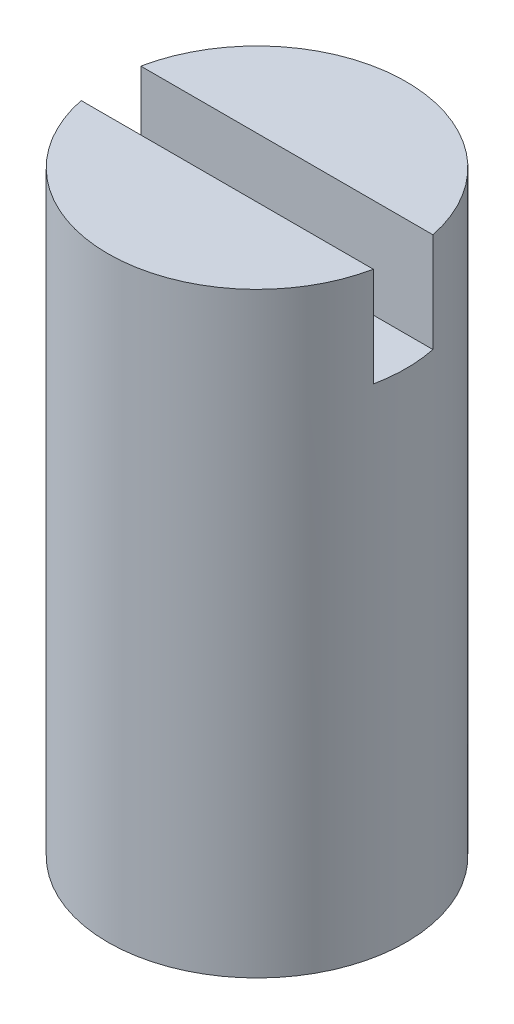
ISO-10303-21;
HEADER;
FILE_DESCRIPTION(('STEP AP214'),'2;1');
FILE_NAME('part.step','',(''),(''),'','','');
FILE_SCHEMA(('AUTOMOTIVE_DESIGN { 1 0 10303 214 1 1 1 1 }'));
ENDSEC;
DATA;
#1=APPLICATION_CONTEXT('core data for automotive mechanical design processes');
#2=APPLICATION_PROTOCOL_DEFINITION('international standard','automotive_design',2000,#1);
#3=PRODUCT_CONTEXT('',#1,'mechanical');
#4=PRODUCT('Part','Part','',(#3));
#5=PRODUCT_RELATED_PRODUCT_CATEGORY('part','',(#4));
#6=PRODUCT_DEFINITION_FORMATION('','',#4);
#7=PRODUCT_DEFINITION_CONTEXT('part definition',#1,'design');
#8=PRODUCT_DEFINITION('design','',#6,#7);
#9=PRODUCT_DEFINITION_SHAPE('','',#8);
#10=(LENGTH_UNIT() NAMED_UNIT(*) SI_UNIT(.MILLI.,.METRE.));
#11=(NAMED_UNIT(*) PLANE_ANGLE_UNIT() SI_UNIT($,.RADIAN.));
#12=(NAMED_UNIT(*) SI_UNIT($,.STERADIAN.) SOLID_ANGLE_UNIT());
#13=UNCERTAINTY_MEASURE_WITH_UNIT(LENGTH_MEASURE(1.E-05),#10,'distance_accuracy_value','');
#14=(GEOMETRIC_REPRESENTATION_CONTEXT(3) GLOBAL_UNCERTAINTY_ASSIGNED_CONTEXT((#13)) GLOBAL_UNIT_ASSIGNED_CONTEXT((#10,
#11,#12)) REPRESENTATION_CONTEXT('',''));
#15=CARTESIAN_POINT('',(0.,0.,0.));
#16=DIRECTION('',(0.,0.,1.));
#17=DIRECTION('',(1.,0.,0.));
#18=AXIS2_PLACEMENT_3D('',#15,#16,#17);
#19=CARTESIAN_POINT('',(0.,0.,0.));
#20=DIRECTION('',(0.,1.,0.));
#21=DIRECTION('',(0.,0.,1.));
#22=AXIS2_PLACEMENT_3D('',#19,#20,#21);
#23=PLANE('',#22);
#24=DIRECTION('',(-1.,0.,0.));
#25=VECTOR('',#24,1.);
#26=CARTESIAN_POINT('',(0.,0.,-0.952500000000001));
#27=LINE('',#26,#25);
#28=CARTESIAN_POINT('',(4.66627796000195,0.,-0.952500000000002));
#29=VERTEX_POINT('',#28);
#30=CARTESIAN_POINT('',(-4.66627796000195,0.,-0.9525));
#31=VERTEX_POINT('',#30);
#32=EDGE_CURVE('E87',#29,#31,#27,.T.);
#33=ORIENTED_EDGE('',*,*,#32,.F.);
#34=CARTESIAN_POINT('',(0.,0.,0.));
#35=DIRECTION('',(0.,1.,0.));
#36=DIRECTION('',(0.,0.,1.));
#37=AXIS2_PLACEMENT_3D('',#34,#35,#36);
#38=CIRCLE('',#37,4.7625);
#39=EDGE_CURVE('E98',#29,#31,#38,.T.);
#40=ORIENTED_EDGE('',*,*,#39,.T.);
#41=EDGE_LOOP('',(#33,#40));
#42=FACE_BOUND('',#41,.T.);
#43=ADVANCED_FACE('F39',(#42),#23,.T.);
#44=CARTESIAN_POINT('',(0.,-19.05,0.));
#45=DIRECTION('',(0.,1.,0.));
#46=DIRECTION('',(0.,0.,1.));
#47=AXIS2_PLACEMENT_3D('',#44,#45,#46);
#48=CYLINDRICAL_SURFACE('',#47,4.7625);
#49=DIRECTION('',(0.,1.,0.));
#50=VECTOR('',#49,1.);
#51=CARTESIAN_POINT('',(-4.66627796000195,-19.05,-0.9525));
#52=LINE('',#51,#50);
#53=CARTESIAN_POINT('',(-4.66627796000195,-3.175,-0.9525));
#54=VERTEX_POINT('',#53);
#55=EDGE_CURVE('E99',#31,#54,#52,.F.);
#56=ORIENTED_EDGE('',*,*,#55,.F.);
#57=ORIENTED_EDGE('',*,*,#39,.F.);
#58=DIRECTION('',(0.,1.,0.));
#59=VECTOR('',#58,1.);
#60=CARTESIAN_POINT('',(4.66627796000195,-19.05,-0.952500000000002));
#61=LINE('',#60,#59);
#62=CARTESIAN_POINT('',(4.66627796000195,-3.175,-0.952500000000002));
#63=VERTEX_POINT('',#62);
#64=EDGE_CURVE('E94',#63,#29,#61,.T.);
#65=ORIENTED_EDGE('',*,*,#64,.F.);
#66=CARTESIAN_POINT('',(0.,-3.175,0.));
#67=DIRECTION('',(0.,-1.,0.));
#68=DIRECTION('',(0.,0.,-1.));
#69=AXIS2_PLACEMENT_3D('',#66,#67,#68);
#70=CIRCLE('',#69,4.7625);
#71=CARTESIAN_POINT('',(4.66627796000195,-3.175,0.952499999999998));
#72=VERTEX_POINT('',#71);
#73=EDGE_CURVE('E43',#72,#63,#70,.F.);
#74=ORIENTED_EDGE('',*,*,#73,.F.);
#75=DIRECTION('',(0.,1.,0.));
#76=VECTOR('',#75,1.);
#77=CARTESIAN_POINT('',(4.66627796000195,-19.05,0.952499999999998));
#78=LINE('',#77,#76);
#79=CARTESIAN_POINT('',(4.66627796000195,0.,0.952499999999998));
#80=VERTEX_POINT('',#79);
#81=EDGE_CURVE('E81',#80,#72,#78,.F.);
#82=ORIENTED_EDGE('',*,*,#81,.F.);
#83=CARTESIAN_POINT('',(-4.66627796000195,0.,0.9525));
#84=VERTEX_POINT('',#83);
#85=EDGE_CURVE('E91',#84,#80,#38,.T.);
#86=ORIENTED_EDGE('',*,*,#85,.F.);
#87=DIRECTION('',(0.,1.,0.));
#88=VECTOR('',#87,1.);
#89=CARTESIAN_POINT('',(-4.66627796000195,-19.05,0.9525));
#90=LINE('',#89,#88);
#91=CARTESIAN_POINT('',(-4.66627796000195,-3.175,0.9525));
#92=VERTEX_POINT('',#91);
#93=EDGE_CURVE('E55',#92,#84,#90,.T.);
#94=ORIENTED_EDGE('',*,*,#93,.F.);
#95=EDGE_CURVE('E11',#54,#92,#70,.F.);
#96=ORIENTED_EDGE('',*,*,#95,.F.);
#97=EDGE_LOOP('',(#56,#57,#65,#74,#82,#86,#94,#96));
#98=FACE_BOUND('',#97,.T.);
#99=CARTESIAN_POINT('',(0.,-19.05,0.));
#100=DIRECTION('',(0.,1.,0.));
#101=DIRECTION('',(0.,0.,1.));
#102=AXIS2_PLACEMENT_3D('',#99,#100,#101);
#103=CIRCLE('',#102,4.7625);
#104=CARTESIAN_POINT('',(0.,-19.05,4.7625));
#105=VERTEX_POINT('',#104);
#106=EDGE_CURVE('E88',#105,#105,#103,.T.);
#107=ORIENTED_EDGE('',*,*,#106,.T.);
#108=EDGE_LOOP('',(#107));
#109=FACE_BOUND('',#108,.T.);
#110=ADVANCED_FACE('F41',(#98,#109),#48,.T.);
#111=CARTESIAN_POINT('',(0.,-19.05,0.));
#112=DIRECTION('',(0.,1.,0.));
#113=DIRECTION('',(0.,0.,1.));
#114=AXIS2_PLACEMENT_3D('',#111,#112,#113);
#115=PLANE('',#114);
#116=CARTESIAN_POINT('',(0.,-19.05,0.));
#117=DIRECTION('',(0.,-1.,0.));
#118=DIRECTION('',(0.,0.,-1.));
#119=AXIS2_PLACEMENT_3D('',#116,#117,#118);
#120=CIRCLE('',#119,2.);
#121=CARTESIAN_POINT('',(0.,-19.05,-2.));
#122=VERTEX_POINT('',#121);
#123=EDGE_CURVE('E128',#122,#122,#120,.T.);
#124=ORIENTED_EDGE('',*,*,#123,.F.);
#125=EDGE_LOOP('',(#124));
#126=FACE_BOUND('',#125,.T.);
#127=ORIENTED_EDGE('',*,*,#106,.F.);
#128=EDGE_LOOP('',(#127));
#129=FACE_BOUND('',#128,.T.);
#130=ADVANCED_FACE('F144',(#126,#129),#115,.F.);
#131=DIRECTION('',(1.,0.,0.));
#132=VECTOR('',#131,1.);
#133=CARTESIAN_POINT('',(0.,0.,0.952499999999999));
#134=LINE('',#133,#132);
#135=EDGE_CURVE('E78',#84,#80,#134,.T.);
#136=ORIENTED_EDGE('',*,*,#135,.F.);
#137=ORIENTED_EDGE('',*,*,#85,.T.);
#138=EDGE_LOOP('',(#136,#137));
#139=FACE_BOUND('',#138,.T.);
#140=ADVANCED_FACE('F96',(#139),#23,.T.);
#141=CARTESIAN_POINT('',(4.7625,-3.175,-0.952500000000002));
#142=DIRECTION('',(0.,0.,-1.));
#143=DIRECTION('',(-1.,0.,0.));
#144=AXIS2_PLACEMENT_3D('',#141,#142,#143);
#145=PLANE('',#144);
#146=ORIENTED_EDGE('',*,*,#55,.T.);
#147=DIRECTION('',(-1.,0.,0.));
#148=VECTOR('',#147,1.);
#149=CARTESIAN_POINT('',(4.7625,-3.175,-0.952500000000002));
#150=LINE('',#149,#148);
#151=EDGE_CURVE('E114',#63,#54,#150,.T.);
#152=ORIENTED_EDGE('',*,*,#151,.F.);
#153=ORIENTED_EDGE('',*,*,#64,.T.);
#154=ORIENTED_EDGE('',*,*,#32,.T.);
#155=EDGE_LOOP('',(#146,#152,#153,#154));
#156=FACE_BOUND('',#155,.T.);
#157=ADVANCED_FACE('F116',(#156),#145,.F.);
#158=CARTESIAN_POINT('',(4.7625,-3.175,0.952499999999998));
#159=DIRECTION('',(0.,0.,1.));
#160=DIRECTION('',(1.,0.,0.));
#161=AXIS2_PLACEMENT_3D('',#158,#159,#160);
#162=PLANE('',#161);
#163=ORIENTED_EDGE('',*,*,#81,.T.);
#164=DIRECTION('',(1.,0.,0.));
#165=VECTOR('',#164,1.);
#166=CARTESIAN_POINT('',(4.7625,-3.175,0.952499999999998));
#167=LINE('',#166,#165);
#168=EDGE_CURVE('E115',#92,#72,#167,.T.);
#169=ORIENTED_EDGE('',*,*,#168,.F.);
#170=ORIENTED_EDGE('',*,*,#93,.T.);
#171=ORIENTED_EDGE('',*,*,#135,.T.);
#172=EDGE_LOOP('',(#163,#169,#170,#171));
#173=FACE_BOUND('',#172,.T.);
#174=ADVANCED_FACE('F80',(#173),#162,.F.);
#175=CARTESIAN_POINT('',(0.,-3.175,0.));
#176=DIRECTION('',(0.,-1.,0.));
#177=DIRECTION('',(0.,0.,-1.));
#178=AXIS2_PLACEMENT_3D('',#175,#176,#177);
#179=PLANE('',#178);
#180=ORIENTED_EDGE('',*,*,#151,.T.);
#181=ORIENTED_EDGE('',*,*,#95,.T.);
#182=ORIENTED_EDGE('',*,*,#168,.T.);
#183=ORIENTED_EDGE('',*,*,#73,.T.);
#184=EDGE_LOOP('',(#180,#181,#182,#183));
#185=FACE_BOUND('',#184,.T.);
#186=ADVANCED_FACE('F113',(#185),#179,.F.);
#187=CARTESIAN_POINT('',(0.,-11.05,0.));
#188=DIRECTION('',(0.,-1.,0.));
#189=DIRECTION('',(0.,0.,-1.));
#190=AXIS2_PLACEMENT_3D('',#187,#188,#189);
#191=CYLINDRICAL_SURFACE('',#190,2.);
#192=CARTESIAN_POINT('',(0.,-11.05,0.));
#193=DIRECTION('',(0.,-1.,0.));
#194=DIRECTION('',(0.,0.,-1.));
#195=AXIS2_PLACEMENT_3D('',#192,#193,#194);
#196=CIRCLE('',#195,2.);
#197=CARTESIAN_POINT('',(0.,-11.05,-2.));
#198=VERTEX_POINT('',#197);
#199=EDGE_CURVE('E127',#198,#198,#196,.T.);
#200=ORIENTED_EDGE('',*,*,#199,.F.);
#201=EDGE_LOOP('',(#200));
#202=FACE_BOUND('',#201,.T.);
#203=ORIENTED_EDGE('',*,*,#123,.T.);
#204=EDGE_LOOP('',(#203));
#205=FACE_BOUND('',#204,.T.);
#206=ADVANCED_FACE('F138',(#202,#205),#191,.F.);
#207=CARTESIAN_POINT('',(0.,-11.05,0.));
#208=DIRECTION('',(0.,-1.,0.));
#209=DIRECTION('',(0.,0.,-1.));
#210=AXIS2_PLACEMENT_3D('',#207,#208,#209);
#211=PLANE('',#210);
#212=ORIENTED_EDGE('',*,*,#199,.T.);
#213=EDGE_LOOP('',(#212));
#214=FACE_BOUND('',#213,.T.);
#215=ADVANCED_FACE('F136',(#214),#211,.T.);
#216=CLOSED_SHELL('',(#43,#110,#130,#140,#157,#174,#186,#206,#215));
#217=MANIFOLD_SOLID_BREP('B2',#216);
#218=ADVANCED_BREP_SHAPE_REPRESENTATION('',(#18,#217),#14);
#219=SHAPE_DEFINITION_REPRESENTATION(#9,#218);
ENDSEC;
END-ISO-10303-21;
